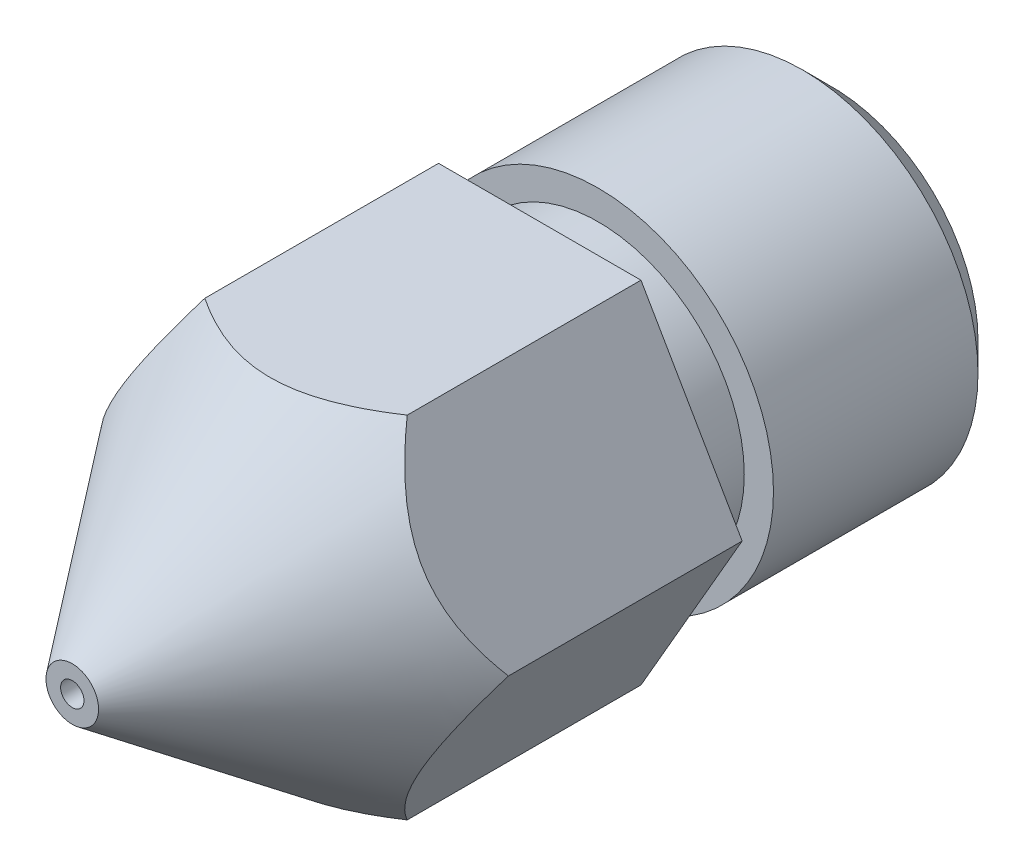
ISO-10303-21;
HEADER;
FILE_DESCRIPTION(('STEP AP214'),'2;1');
FILE_NAME('part.step','',(''),(''),'','','');
FILE_SCHEMA(('AUTOMOTIVE_DESIGN { 1 0 10303 214 1 1 1 1 }'));
ENDSEC;
DATA;
#1=APPLICATION_CONTEXT('core data for automotive mechanical design processes');
#2=APPLICATION_PROTOCOL_DEFINITION('international standard','automotive_design',2000,#1);
#3=PRODUCT_CONTEXT('',#1,'mechanical');
#4=PRODUCT('Part','Part','',(#3));
#5=PRODUCT_RELATED_PRODUCT_CATEGORY('part','',(#4));
#6=PRODUCT_DEFINITION_FORMATION('','',#4);
#7=PRODUCT_DEFINITION_CONTEXT('part definition',#1,'design');
#8=PRODUCT_DEFINITION('design','',#6,#7);
#9=PRODUCT_DEFINITION_SHAPE('','',#8);
#10=(LENGTH_UNIT() NAMED_UNIT(*) SI_UNIT(.MILLI.,.METRE.));
#11=(NAMED_UNIT(*) PLANE_ANGLE_UNIT() SI_UNIT($,.RADIAN.));
#12=(NAMED_UNIT(*) SI_UNIT($,.STERADIAN.) SOLID_ANGLE_UNIT());
#13=UNCERTAINTY_MEASURE_WITH_UNIT(LENGTH_MEASURE(1.E-05),#10,'distance_accuracy_value','');
#14=(GEOMETRIC_REPRESENTATION_CONTEXT(3) GLOBAL_UNCERTAINTY_ASSIGNED_CONTEXT((#13)) GLOBAL_UNIT_ASSIGNED_CONTEXT((#10,
#11,#12)) REPRESENTATION_CONTEXT('',''));
#15=CARTESIAN_POINT('',(0.,0.,0.));
#16=DIRECTION('',(0.,0.,1.));
#17=DIRECTION('',(1.,0.,0.));
#18=AXIS2_PLACEMENT_3D('',#15,#16,#17);
#19=CARTESIAN_POINT('',(0.,0.,0.));
#20=DIRECTION('',(0.,0.,1.));
#21=DIRECTION('',(1.,0.,0.));
#22=AXIS2_PLACEMENT_3D('',#19,#20,#21);
#23=CYLINDRICAL_SURFACE('',#22,2.5);
#24=CARTESIAN_POINT('',(0.,0.,0.));
#25=DIRECTION('',(0.,0.,1.));
#26=DIRECTION('',(1.,0.,0.));
#27=AXIS2_PLACEMENT_3D('',#24,#25,#26);
#28=CIRCLE('',#27,2.5);
#29=CARTESIAN_POINT('',(2.49999999999999,0.,0.));
#30=VERTEX_POINT('',#29);
#31=EDGE_CURVE('E20',#30,#30,#28,.F.);
#32=ORIENTED_EDGE('',*,*,#31,.T.);
#33=EDGE_LOOP('',(#32));
#34=FACE_BOUND('',#33,.T.);
#35=CARTESIAN_POINT('',(0.,0.,-1.));
#36=DIRECTION('',(0.,0.,1.));
#37=DIRECTION('',(1.,0.,0.));
#38=AXIS2_PLACEMENT_3D('',#35,#36,#37);
#39=CIRCLE('',#38,2.5);
#40=CARTESIAN_POINT('',(2.49999999999999,0.,-1.));
#41=VERTEX_POINT('',#40);
#42=EDGE_CURVE('E105',#41,#41,#39,.T.);
#43=ORIENTED_EDGE('',*,*,#42,.T.);
#44=EDGE_LOOP('',(#43));
#45=FACE_BOUND('',#44,.T.);
#46=ADVANCED_FACE('F17',(#34,#45),#23,.T.);
#47=CARTESIAN_POINT('',(0.,0.,0.));
#48=DIRECTION('',(0.,0.,1.));
#49=DIRECTION('',(1.,0.,0.));
#50=AXIS2_PLACEMENT_3D('',#47,#48,#49);
#51=PLANE('',#50);
#52=ORIENTED_EDGE('',*,*,#31,.F.);
#53=EDGE_LOOP('',(#52));
#54=FACE_BOUND('',#53,.T.);
#55=DIRECTION('',(-1.,0.,0.));
#56=VECTOR('',#55,1.);
#57=CARTESIAN_POINT('',(1.73205080756887,3.00000000000001,0.));
#58=LINE('',#57,#56);
#59=CARTESIAN_POINT('',(1.73205080756887,3.00000000000001,0.));
#60=VERTEX_POINT('',#59);
#61=CARTESIAN_POINT('',(-1.73205080756889,2.99999999999999,0.));
#62=VERTEX_POINT('',#61);
#63=EDGE_CURVE('E68',#60,#62,#58,.T.);
#64=ORIENTED_EDGE('',*,*,#63,.F.);
#65=DIRECTION('',(-0.500000000000001,0.866025403784438,0.));
#66=VECTOR('',#65,1.);
#67=CARTESIAN_POINT('',(3.46410161513776,0.,0.));
#68=LINE('',#67,#66);
#69=CARTESIAN_POINT('',(3.46410161513776,0.,0.));
#70=VERTEX_POINT('',#69);
#71=EDGE_CURVE('E98',#70,#60,#68,.T.);
#72=ORIENTED_EDGE('',*,*,#71,.F.);
#73=DIRECTION('',(0.499999999999995,0.866025403784442,0.));
#74=VECTOR('',#73,1.);
#75=CARTESIAN_POINT('',(1.73205080756891,-2.99999999999998,0.));
#76=LINE('',#75,#74);
#77=CARTESIAN_POINT('',(1.73205080756891,-2.99999999999998,0.));
#78=VERTEX_POINT('',#77);
#79=EDGE_CURVE('E103',#78,#70,#76,.T.);
#80=ORIENTED_EDGE('',*,*,#79,.F.);
#81=DIRECTION('',(1.,0.,0.));
#82=VECTOR('',#81,1.);
#83=CARTESIAN_POINT('',(-1.73205080756885,-3.00000000000002,0.));
#84=LINE('',#83,#82);
#85=CARTESIAN_POINT('',(-1.73205080756885,-3.00000000000002,0.));
#86=VERTEX_POINT('',#85);
#87=EDGE_CURVE('E109',#86,#78,#84,.T.);
#88=ORIENTED_EDGE('',*,*,#87,.F.);
#89=DIRECTION('',(0.500000000000007,-0.866025403784435,0.));
#90=VECTOR('',#89,1.);
#91=CARTESIAN_POINT('',(-3.46410161513776,0.,0.));
#92=LINE('',#91,#90);
#93=CARTESIAN_POINT('',(-3.46410161513776,0.,0.));
#94=VERTEX_POINT('',#93);
#95=EDGE_CURVE('E86',#94,#86,#92,.T.);
#96=ORIENTED_EDGE('',*,*,#95,.F.);
#97=DIRECTION('',(-0.499999999999995,-0.866025403784442,0.));
#98=VECTOR('',#97,1.);
#99=CARTESIAN_POINT('',(-1.73205080756889,2.99999999999999,0.));
#100=LINE('',#99,#98);
#101=EDGE_CURVE('E80',#62,#94,#100,.T.);
#102=ORIENTED_EDGE('',*,*,#101,.F.);
#103=EDGE_LOOP('',(#64,#72,#80,#88,#96,#102));
#104=FACE_BOUND('',#103,.T.);
#105=ADVANCED_FACE('F84',(#54,#104),#51,.F.);
#106=CARTESIAN_POINT('',(-3.46410161513776,0.,8.));
#107=DIRECTION('',(-0.866025403784435,-0.500000000000007,0.));
#108=DIRECTION('',(0.500000000000007,-0.866025403784435,0.));
#109=AXIS2_PLACEMENT_3D('',#106,#107,#108);
#110=PLANE('',#109);
#111=ORIENTED_EDGE('',*,*,#95,.T.);
#112=DIRECTION('',(0.,0.,1.));
#113=VECTOR('',#112,1.);
#114=CARTESIAN_POINT('',(-1.73205080756885,-3.00000000000002,8.));
#115=LINE('',#114,#113);
#116=CARTESIAN_POINT('',(-1.73205082261457,-2.99999997394007,4.00000001990856));
#117=VERTEX_POINT('',#116);
#118=EDGE_CURVE('E111',#117,#86,#115,.F.);
#119=ORIENTED_EDGE('',*,*,#118,.F.);
#120=CARTESIAN_POINT('',(-3.46410161512749,-1.78090844095584E-11,3.99999999995585));
#121=CARTESIAN_POINT('',(-3.44069021728598,-0.0405497305555014,4.0310628053538));
#122=CARTESIAN_POINT('',(-3.41706085238584,-0.0814769911131405,4.06148013029268));
#123=CARTESIAN_POINT('',(-3.36934820183696,-0.16411772602758,4.12079172064874));
#124=CARTESIAN_POINT('',(-3.34526518086492,-0.205830741950901,4.14968683895466));
#125=CARTESIAN_POINT('',(-3.29644056578324,-0.290397455932351,4.20594219265243));
#126=CARTESIAN_POINT('',(-3.27169567941122,-0.333256856356211,4.23329106871594));
#127=CARTESIAN_POINT('',(-3.22165527143299,-0.419929385405982,4.28600265818764));
#128=CARTESIAN_POINT('',(-3.19635926529786,-0.463743353260596,4.31136352565853));
#129=CARTESIAN_POINT('',(-3.11910484462331,-0.597551934978225,4.3845024985927));
#130=CARTESIAN_POINT('',(-3.06628459171059,-0.689039296691687,4.42874210619825));
#131=CARTESIAN_POINT('',(-2.95848675569459,-0.875750625617379,4.50488649686758));
#132=CARTESIAN_POINT('',(-2.9035124162864,-0.970968974584896,4.53680909624767));
#133=CARTESIAN_POINT('',(-2.81448457704596,-1.1251697154374,4.57560860596397));
#134=CARTESIAN_POINT('',(-2.78095977027534,-1.18323638407805,4.58739343695509));
#135=CARTESIAN_POINT('',(-2.71351247814955,-1.30005852087285,4.60510403197278));
#136=CARTESIAN_POINT('',(-2.67958993696148,-1.35881408573244,4.61102896319209));
#137=CARTESIAN_POINT('',(-2.61188290906255,-1.47608609808287,4.61672020179017));
#138=CARTESIAN_POINT('',(-2.57809943786469,-1.5346007866536,4.61653462503732));
#139=CARTESIAN_POINT('',(-2.51067843635983,-1.6513773867572,4.61013433411967));
#140=CARTESIAN_POINT('',(-2.47704090125166,-1.70963930660593,4.6039198198358));
#141=CARTESIAN_POINT('',(-2.41030893019044,-1.82522247097317,4.58577671747795));
#142=CARTESIAN_POINT('',(-2.37721275011841,-1.88254673639436,4.57387352526923));
#143=CARTESIAN_POINT('',(-2.31159334327444,-1.99620288301066,4.54483585433414));
#144=CARTESIAN_POINT('',(-2.27907037936965,-2.05253430890648,4.52769903835235));
#145=CARTESIAN_POINT('',(-2.18215411721515,-2.22039819903774,4.46905909519213));
#146=CARTESIAN_POINT('',(-2.11882576441585,-2.33008612364577,4.42045072352064));
#147=CARTESIAN_POINT('',(-1.99999917816462,-2.53589980832286,4.313482497851));
#148=CARTESIAN_POINT('',(-1.94426869692903,-2.63242783335316,4.25611473073038));
#149=CARTESIAN_POINT('',(-1.86291673372508,-2.77333356691788,4.16391653954198));
#150=CARTESIAN_POINT('',(-1.83634125898785,-2.81936363939803,4.13238684651579));
#151=CARTESIAN_POINT('',(-1.78377384701409,-2.91041306775898,4.06749851398277));
#152=CARTESIAN_POINT('',(-1.75778159469871,-2.95543296937237,4.03414089723963));
#153=CARTESIAN_POINT('',(-1.73205083766029,-2.99999994788013,4.0000000398749));
#154=B_SPLINE_CURVE_WITH_KNOTS('',3,(#120,#121,#122,#123,#124,#125,#126,#127,#128,#129,#130,
#131,#132,#133,#134,#135,#136,#137,#138,#139,#140,#141,#142,#143,#144,#145,#146,#147,#148,#149,
#150,#151,#152,#153),.UNSPECIFIED.,.F.,.F.,(4,2,2,2,2,2,2,2,2,2,2,2,2,2,2,2,4),(0.,
0.168572565033998,0.337049652156391,0.506636087692028,0.676378169632626,1.01936499807178,
1.36185382588792,1.56586036237278,1.7698958880427,1.9723251673403,2.17474773560912,
2.37627495577819,2.57789230681761,2.98360296012187,3.3591882030421,3.54455388709552,
3.72981689344194),.UNSPECIFIED.);
#155=CARTESIAN_POINT('',(-3.46410161513399,0.,3.99999999996893));
#156=VERTEX_POINT('',#155);
#157=EDGE_CURVE('E88',#156,#117,#154,.T.);
#158=ORIENTED_EDGE('',*,*,#157,.F.);
#159=DIRECTION('',(0.,0.,1.));
#160=VECTOR('',#159,1.);
#161=CARTESIAN_POINT('',(-3.46410161513776,0.,8.));
#162=LINE('',#161,#160);
#163=EDGE_CURVE('E34',#94,#156,#162,.T.);
#164=ORIENTED_EDGE('',*,*,#163,.F.);
#165=EDGE_LOOP('',(#111,#119,#158,#164));
#166=FACE_BOUND('',#165,.T.);
#167=ADVANCED_FACE('F184',(#166),#110,.T.);
#168=CARTESIAN_POINT('',(-1.73205080756885,-3.00000000000002,8.));
#169=DIRECTION('',(0.,-1.,0.));
#170=DIRECTION('',(1.,0.,0.));
#171=AXIS2_PLACEMENT_3D('',#168,#169,#170);
#172=PLANE('',#171);
#173=ORIENTED_EDGE('',*,*,#87,.T.);
#174=DIRECTION('',(0.,0.,1.));
#175=VECTOR('',#174,1.);
#176=CARTESIAN_POINT('',(1.73205080756891,-2.99999999999998,8.));
#177=LINE('',#176,#175);
#178=CARTESIAN_POINT('',(1.73205077747104,-2.99999999999998,4.00000001991283));
#179=VERTEX_POINT('',#178);
#180=EDGE_CURVE('E106',#179,#78,#177,.F.);
#181=ORIENTED_EDGE('',*,*,#180,.F.);
#182=CARTESIAN_POINT('',(-1.73205080390475,-2.99999997395749,3.99999998902961));
#183=CARTESIAN_POINT('',(-1.68522801225279,-2.9999999906465,4.03106280033602));
#184=CARTESIAN_POINT('',(-1.63796928421497,-2.99999999749357,4.06148012765403));
#185=CARTESIAN_POINT('',(-1.54254398469325,-3.00000000250505,4.12079171963457));
#186=CARTESIAN_POINT('',(-1.4943779425648,-3.00000000067438,4.1496868371891));
#187=CARTESIAN_POINT('',(-1.39672871265291,-2.99999999932121,4.2059421901906));
#188=CARTESIAN_POINT('',(-1.34723894034983,-2.99999999981398,4.23329106631756));
#189=CARTESIAN_POINT('',(-1.24715812512532,-3.00000000018622,4.28600265574057));
#190=CARTESIAN_POINT('',(-1.19656611314546,-3.00000000006513,4.31136352309826));
#191=CARTESIAN_POINT('',(-1.04205727283146,-2.99999999986843,4.38450249576049));
#192=CARTESIAN_POINT('',(-0.936416767816112,-2.99999999996537,4.42874210333507));
#193=CARTESIAN_POINT('',(-0.720821097463859,-3.00000000003459,4.50488649411916));
#194=CARTESIAN_POINT('',(-0.610872419518798,-3.00000000000705,4.53680909364931));
#195=CARTESIAN_POINT('',(-0.432816742046975,-2.99999999999581,4.57560860393632));
#196=CARTESIAN_POINT('',(-0.365767128635706,-2.99999999999888,4.58739343521679));
#197=CARTESIAN_POINT('',(-0.230872544635614,-3.00000000000113,4.60510403084387));
#198=CARTESIAN_POINT('',(-0.16302746238116,-3.0000000000003,4.61102896238462));
#199=CARTESIAN_POINT('',(-0.0276134067728522,-2.9999999999997,4.61672020164859));
#200=CARTESIAN_POINT('',(0.0399535355548584,-2.99999999999992,4.61653462523792));
#201=CARTESIAN_POINT('',(0.174795538465503,-3.00000000000008,4.61013433500813));
#202=CARTESIAN_POINT('',(0.242070608650749,-3.00000000000002,4.60391982106944));
#203=CARTESIAN_POINT('',(0.375534550747317,-2.99999999999998,4.58577671938737));
#204=CARTESIAN_POINT('',(0.441726910896373,-2.99999999999999,4.57387352750857));
#205=CARTESIAN_POINT('',(0.572965724614914,-3.,4.54483585721002));
#206=CARTESIAN_POINT('',(0.638011652450085,-3.,4.52769904153483));
#207=CARTESIAN_POINT('',(0.831844176842158,-2.99999999999999,4.4690590992579));
#208=CARTESIAN_POINT('',(0.958500882518724,-2.99999999999999,4.42045072812008));
#209=CARTESIAN_POINT('',(1.19615405717397,-2.99999999999999,4.31348250246958));
#210=CARTESIAN_POINT('',(1.30761502162218,-2.99999999999999,4.25611473463496));
#211=CARTESIAN_POINT('',(1.47031895084624,-2.99999999999998,4.16391654213468));
#212=CARTESIAN_POINT('',(1.52346990122852,-2.99999999999998,4.13238684863528));
#213=CARTESIAN_POINT('',(1.62860472694999,-2.99999999999998,4.06749851509162));
#214=CARTESIAN_POINT('',(1.68058923244697,-2.99999999999998,4.03414089781116));
#215=CARTESIAN_POINT('',(1.73205074737316,-2.99999999999998,4.00000003988345));
#216=B_SPLINE_CURVE_WITH_KNOTS('',3,(#182,#183,#184,#185,#186,#187,#188,#189,#190,#191,#192,
#193,#194,#195,#196,#197,#198,#199,#200,#201,#202,#203,#204,#205,#206,#207,#208,#209,#210,#211,
#212,#213,#214,#215),.UNSPECIFIED.,.F.,.F.,(4,2,2,2,2,2,2,2,2,2,2,2,2,2,2,2,4),(0.,
0.168572564445729,0.337049650810836,0.50663608532369,0.676378166317596,1.01936499251818,
1.36185381797032,1.56586035422516,1.76989587961715,1.97232515870881,2.17474772678902,
2.37627494679629,2.57789229767387,2.98360295060958,3.35918819974785,3.54455388686658,
3.72981689626899),.UNSPECIFIED.);
#217=EDGE_CURVE('E170',#117,#179,#216,.T.);
#218=ORIENTED_EDGE('',*,*,#217,.F.);
#219=ORIENTED_EDGE('',*,*,#118,.T.);
#220=EDGE_LOOP('',(#173,#181,#218,#219));
#221=FACE_BOUND('',#220,.T.);
#222=ADVANCED_FACE('F179',(#221),#172,.T.);
#223=CARTESIAN_POINT('',(1.73205080756891,-2.99999999999998,8.));
#224=DIRECTION('',(0.866025403784442,-0.499999999999995,0.));
#225=DIRECTION('',(0.499999999999995,0.866025403784442,0.));
#226=AXIS2_PLACEMENT_3D('',#223,#224,#225);
#227=PLANE('',#226);
#228=ORIENTED_EDGE('',*,*,#79,.T.);
#229=DIRECTION('',(0.,0.,1.));
#230=VECTOR('',#229,1.);
#231=CARTESIAN_POINT('',(3.46410161513776,0.,8.));
#232=LINE('',#231,#230);
#233=CARTESIAN_POINT('',(3.46410161513021,0.,3.99999999995224));
#234=VERTEX_POINT('',#233);
#235=EDGE_CURVE('E100',#234,#70,#232,.F.);
#236=ORIENTED_EDGE('',*,*,#235,.F.);
#237=CARTESIAN_POINT('',(1.73205078683702,-2.9999999838129,3.99999998901916));
#238=CARTESIAN_POINT('',(1.75546219711762,-2.95945026511495,4.03106280032556));
#239=CARTESIAN_POINT('',(1.77909156706624,-2.91852300951005,4.0614801276429));
#240=CARTESIAN_POINT('',(1.82680422116572,-2.83588227847082,4.12079171962161));
#241=CARTESIAN_POINT('',(1.85088724064311,-2.79416926147422,4.14968683717497));
#242=CARTESIAN_POINT('',(1.89971185442462,-2.70960254703781,4.2059421901745));
#243=CARTESIAN_POINT('',(1.92445674100179,-2.66674314724437,4.23329106630065));
#244=CARTESIAN_POINT('',(1.97449714893402,-2.58007061901892,4.28600265572225));
#245=CARTESIAN_POINT('',(1.99979315481781,-2.5362566513574,4.31136352307933));
#246=CARTESIAN_POINT('',(2.07704757480595,-2.40244807043521,4.38450249574526));
#247=CARTESIAN_POINT('',(2.12986782740052,-2.31096070946671,4.42874210332363));
#248=CARTESIAN_POINT('',(2.23766566264272,-2.12424938201975,4.50488649411404));
#249=CARTESIAN_POINT('',(2.2926400015946,-2.0290310337875,4.53680909364672));
#250=CARTESIAN_POINT('',(2.38166784032611,-1.87483029379397,4.57560860393638));
#251=CARTESIAN_POINT('',(2.41519264703649,-1.81676362526382,4.58739343521754));
#252=CARTESIAN_POINT('',(2.48263993904267,-1.69994148868068,4.60510403084524));
#253=CARTESIAN_POINT('',(2.51656248017129,-1.64118592392241,4.61102896238593));
#254=CARTESIAN_POINT('',(2.58426950797496,-1.52391391173578,4.61672020164866));
#255=CARTESIAN_POINT('',(2.61805297913691,-1.46539922322767,4.61653462523756));
#256=CARTESIAN_POINT('',(2.68547398058824,-1.34862262321711,4.61013433500767));
#257=CARTESIAN_POINT('',(2.71911151567878,-1.2903607033988,4.60391982106929));
#258=CARTESIAN_POINT('',(2.78584348671839,-1.17477753906889,4.58577671938979));
#259=CARTESIAN_POINT('',(2.81893966678639,-1.11745327365469,4.57387352751402));
#260=CARTESIAN_POINT('',(2.88455907363292,-1.00379712703399,4.54483585722354));
#261=CARTESIAN_POINT('',(2.9170820375443,-0.947465701126749,4.52769904155341));
#262=CARTESIAN_POINT('',(3.01399829974689,-0.779601810912185,4.46905909927857));
#263=CARTESIAN_POINT('',(3.07732665259602,-0.669913886217841,4.42045072813286));
#264=CARTESIAN_POINT('',(3.19615324550639,-0.464100190006776,4.31348249746097));
#265=CARTESIAN_POINT('',(3.25188373303114,-0.367572154083333,4.25611472345713));
#266=CARTESIAN_POINT('',(3.33323570517356,-0.226666405036735,4.16391652072528));
#267=CARTESIAN_POINT('',(3.35981118277317,-0.180636327598797,4.13238682370177));
#268=CARTESIAN_POINT('',(3.41237860034698,-0.0895868895382563,4.06749848284485));
#269=CARTESIAN_POINT('',(3.43837085540024,-0.0445669831827226,4.03414086177575));
#270=CARTESIAN_POINT('',(3.46410161512749,-1.77906543640029E-11,3.99999999995585));
#271=B_SPLINE_CURVE_WITH_KNOTS('',3,(#237,#238,#239,#240,#241,#242,#243,#244,#245,#246,#247,
#248,#249,#250,#251,#252,#253,#254,#255,#256,#257,#258,#259,#260,#261,#262,#263,#264,#265,#266,
#267,#268,#269,#270),.UNSPECIFIED.,.F.,.F.,(4,2,2,2,2,2,2,2,2,2,2,2,2,2,2,2,4),(0.,
0.168572564438344,0.337049650796003,0.50663608530132,0.676378166287717,1.01936499250879,
1.36185381798131,1.56586035424876,1.76989587965327,1.97232515873247,2.17474772680038,
2.37627494676785,2.57789229760461,2.98360295062125,3.35918823635118,3.54455394128791,
3.72981696846106),.UNSPECIFIED.);
#272=EDGE_CURVE('E165',#179,#234,#271,.T.);
#273=ORIENTED_EDGE('',*,*,#272,.F.);
#274=ORIENTED_EDGE('',*,*,#180,.T.);
#275=EDGE_LOOP('',(#228,#236,#273,#274));
#276=FACE_BOUND('',#275,.T.);
#277=ADVANCED_FACE('F176',(#276),#227,.T.);
#278=CARTESIAN_POINT('',(2.99999999999999,0.,-1.));
#279=DIRECTION('',(0.,0.,-1.));
#280=DIRECTION('',(-1.,0.,0.));
#281=AXIS2_PLACEMENT_3D('',#278,#279,#280);
#282=PLANE('',#281);
#283=CARTESIAN_POINT('',(0.,0.,-1.));
#284=DIRECTION('',(0.,0.,1.));
#285=DIRECTION('',(1.,0.,0.));
#286=AXIS2_PLACEMENT_3D('',#283,#284,#285);
#287=CIRCLE('',#286,2.99999999999999);
#288=CARTESIAN_POINT('',(2.99999999999999,0.,-1.));
#289=VERTEX_POINT('',#288);
#290=EDGE_CURVE('E162',#289,#289,#287,.F.);
#291=ORIENTED_EDGE('',*,*,#290,.F.);
#292=EDGE_LOOP('',(#291));
#293=FACE_BOUND('',#292,.T.);
#294=ORIENTED_EDGE('',*,*,#42,.F.);
#295=EDGE_LOOP('',(#294));
#296=FACE_BOUND('',#295,.T.);
#297=ADVANCED_FACE('F154',(#293,#296),#282,.F.);
#298=CARTESIAN_POINT('',(3.46410161513776,0.,8.));
#299=DIRECTION('',(0.866025403784438,0.500000000000001,0.));
#300=DIRECTION('',(-0.500000000000001,0.866025403784438,0.));
#301=AXIS2_PLACEMENT_3D('',#298,#299,#300);
#302=PLANE('',#301);
#303=ORIENTED_EDGE('',*,*,#71,.T.);
#304=DIRECTION('',(0.,0.,1.));
#305=VECTOR('',#304,1.);
#306=CARTESIAN_POINT('',(1.73205080756887,3.00000000000001,8.));
#307=LINE('',#306,#305);
#308=CARTESIAN_POINT('',(1.73205082261745,2.9999999739351,4.00000001991236));
#309=VERTEX_POINT('',#308);
#310=EDGE_CURVE('E74',#309,#60,#307,.F.);
#311=ORIENTED_EDGE('',*,*,#310,.F.);
#312=CARTESIAN_POINT('',(3.46410161512749,1.77913089255884E-11,3.99999999995585));
#313=CARTESIAN_POINT('',(3.44069021728598,0.040549730555484,4.03106280535381));
#314=CARTESIAN_POINT('',(3.41706085238583,0.0814769911131235,4.06148013029268));
#315=CARTESIAN_POINT('',(3.36934820183695,0.164117726027563,4.12079172064874));
#316=CARTESIAN_POINT('',(3.34526518086491,0.205830741950885,4.14968683895466));
#317=CARTESIAN_POINT('',(3.29644056578324,0.290397455932336,4.20594219265243));
#318=CARTESIAN_POINT('',(3.27169567941122,0.333256856356197,4.23329106871595));
#319=CARTESIAN_POINT('',(3.22165527143299,0.419929385405969,4.28600265818764));
#320=CARTESIAN_POINT('',(3.19635926529786,0.463743353260583,4.31136352565853));
#321=CARTESIAN_POINT('',(3.1191048446233,0.597551934978212,4.3845024985927));
#322=CARTESIAN_POINT('',(3.06628459171059,0.689039296691673,4.42874210619826));
#323=CARTESIAN_POINT('',(2.95848675569459,0.875750625617363,4.50488649686758));
#324=CARTESIAN_POINT('',(2.9035124162864,0.970968974584879,4.53680909624767));
#325=CARTESIAN_POINT('',(2.81448457704597,1.12516971543738,4.57560860596397));
#326=CARTESIAN_POINT('',(2.78095977027535,1.18323638407803,4.58739343695509));
#327=CARTESIAN_POINT('',(2.71351247814956,1.30005852087283,4.60510403197278));
#328=CARTESIAN_POINT('',(2.67958993696149,1.35881408573242,4.61102896319209));
#329=CARTESIAN_POINT('',(2.61188290906256,1.47608609808285,4.61672020179017));
#330=CARTESIAN_POINT('',(2.5780994378647,1.53460078665358,4.61653462503732));
#331=CARTESIAN_POINT('',(2.51067843635984,1.65137738675718,4.61013433411967));
#332=CARTESIAN_POINT('',(2.47704090125167,1.70963930660591,4.6039198198358));
#333=CARTESIAN_POINT('',(2.41030893019045,1.82522247097316,4.58577671747795));
#334=CARTESIAN_POINT('',(2.37721275011842,1.88254673639435,4.57387352526923));
#335=CARTESIAN_POINT('',(2.31159334327445,1.99620288301065,4.54483585433414));
#336=CARTESIAN_POINT('',(2.27907037936966,2.05253430890647,4.52769903835235));
#337=CARTESIAN_POINT('',(2.18215411721516,2.22039819903773,4.46905909519213));
#338=CARTESIAN_POINT('',(2.11882576441586,2.33008612364576,4.42045072352064));
#339=CARTESIAN_POINT('',(1.9999991781657,2.53589980832101,4.31348249785196));
#340=CARTESIAN_POINT('',(1.94426869693112,2.63242783334956,4.25611473073251));
#341=CARTESIAN_POINT('',(1.8629167337286,2.7733335669118,4.16391653954606));
#342=CARTESIAN_POINT('',(1.83634125899183,2.81936363939115,4.13238684652054));
#343=CARTESIAN_POINT('',(1.78377384701897,2.91041306775054,4.06749851398892));
#344=CARTESIAN_POINT('',(1.75778159470403,2.95543296936317,4.03414089724649));
#345=CARTESIAN_POINT('',(1.73205083766604,2.99999994787019,4.00000003988251));
#346=B_SPLINE_CURVE_WITH_KNOTS('',3,(#312,#313,#314,#315,#316,#317,#318,#319,#320,#321,#322,
#323,#324,#325,#326,#327,#328,#329,#330,#331,#332,#333,#334,#335,#336,#337,#338,#339,#340,#341,
#342,#343,#344,#345),.UNSPECIFIED.,.F.,.F.,(4,2,2,2,2,2,2,2,2,2,2,2,2,2,2,2,4),(0.,
0.168572565033999,0.337049652156393,0.506636087692031,0.67637816963263,1.01936499807178,
1.36185382588791,1.56586036237277,1.76989588804269,1.97232516734029,2.17474773560911,
2.37627495577819,2.57789230681762,2.98360296012186,3.35918820303512,3.54455388708515,
3.72981689342818),.UNSPECIFIED.);
#347=EDGE_CURVE('E157',#234,#309,#346,.T.);
#348=ORIENTED_EDGE('',*,*,#347,.F.);
#349=ORIENTED_EDGE('',*,*,#235,.T.);
#350=EDGE_LOOP('',(#303,#311,#348,#349));
#351=FACE_BOUND('',#350,.T.);
#352=ADVANCED_FACE('F150',(#351),#302,.T.);
#353=CARTESIAN_POINT('',(1.73205080756887,3.00000000000001,8.));
#354=DIRECTION('',(0.,1.,0.));
#355=DIRECTION('',(-1.,0.,0.));
#356=AXIS2_PLACEMENT_3D('',#353,#354,#355);
#357=PLANE('',#356);
#358=ORIENTED_EDGE('',*,*,#63,.T.);
#359=DIRECTION('',(0.,0.,1.));
#360=VECTOR('',#359,1.);
#361=CARTESIAN_POINT('',(-1.73205080756889,2.99999999999999,8.));
#362=LINE('',#361,#360);
#363=CARTESIAN_POINT('',(-1.73205077747843,2.99999999999999,4.00000001990792));
#364=VERTEX_POINT('',#363);
#365=EDGE_CURVE('E72',#364,#62,#362,.F.);
#366=ORIENTED_EDGE('',*,*,#365,.F.);
#367=CARTESIAN_POINT('',(1.73205080391511,2.99999997395271,3.99999998902031));
#368=CARTESIAN_POINT('',(1.68522801226358,2.99999999064478,4.03106280032815));
#369=CARTESIAN_POINT('',(1.63796928422576,2.9999999974931,4.06148012764695));
#370=CARTESIAN_POINT('',(1.54254398470369,3.0000000025055,4.12079171962848));
#371=CARTESIAN_POINT('',(1.49437794257489,3.0000000006745,4.14968683718321));
#372=CARTESIAN_POINT('',(1.39672871266237,2.99999999932107,4.20594219018526));
#373=CARTESIAN_POINT('',(1.34723894035902,2.99999999981393,4.23329106631256));
#374=CARTESIAN_POINT('',(1.24715812513394,3.00000000018625,4.28600265573621));
#375=CARTESIAN_POINT('',(1.19656611315377,3.00000000006514,4.31136352309419));
#376=CARTESIAN_POINT('',(1.04205727283882,2.9999999998684,4.38450249575731));
#377=CARTESIAN_POINT('',(0.936416767822808,2.99999999996536,4.42874210333246));
#378=CARTESIAN_POINT('',(0.720821097469165,3.0000000000346,4.50488649411755));
#379=CARTESIAN_POINT('',(0.610872419523375,3.00000000000705,4.53680909364814));
#380=CARTESIAN_POINT('',(0.432816742050784,2.9999999999958,4.5756086039356));
#381=CARTESIAN_POINT('',(0.365767128639503,2.99999999999888,4.58739343521618));
#382=CARTESIAN_POINT('',(0.230872544639381,3.00000000000113,4.60510403084349));
#383=CARTESIAN_POINT('',(0.163027462384909,3.0000000000003,4.61102896238436));
#384=CARTESIAN_POINT('',(0.0276134067765566,2.9999999999997,4.61672020164855));
#385=CARTESIAN_POINT('',(-0.0399535355511795,2.99999999999992,4.61653462523799));
#386=CARTESIAN_POINT('',(-0.174795538461885,3.00000000000008,4.61013433500841));
#387=CARTESIAN_POINT('',(-0.242070608647167,3.00000000000002,4.60391982106982));
#388=CARTESIAN_POINT('',(-0.375534550743816,2.99999999999998,4.58577671938794));
#389=CARTESIAN_POINT('',(-0.441726910892917,2.99999999999999,4.57387352750923));
#390=CARTESIAN_POINT('',(-0.572965724611553,3.,4.54483585721085));
#391=CARTESIAN_POINT('',(-0.638011652446773,3.,4.52769904153574));
#392=CARTESIAN_POINT('',(-0.831844176839013,2.99999999999999,4.46905909925901));
#393=CARTESIAN_POINT('',(-0.958500882515699,3.,4.4204507281213));
#394=CARTESIAN_POINT('',(-1.19615405717434,3.,4.31348250246953));
#395=CARTESIAN_POINT('',(-1.30761502162567,3.,4.2561147346332));
#396=CARTESIAN_POINT('',(-1.47031895085417,3.,4.16391654213006));
#397=CARTESIAN_POINT('',(-1.52346990123786,3.,4.13238684862967));
#398=CARTESIAN_POINT('',(-1.62860472696211,2.99999999999999,4.06749851508396));
#399=CARTESIAN_POINT('',(-1.68058923246044,2.99999999999999,4.03414089780242));
#400=CARTESIAN_POINT('',(-1.73205074738797,2.99999999999999,4.00000003987361));
#401=B_SPLINE_CURVE_WITH_KNOTS('',3,(#367,#368,#369,#370,#371,#372,#373,#374,#375,#376,#377,
#378,#379,#380,#381,#382,#383,#384,#385,#386,#387,#388,#389,#390,#391,#392,#393,#394,#395,#396,
#397,#398,#399,#400),.UNSPECIFIED.,.F.,.F.,(4,2,2,2,2,2,2,2,2,2,2,2,2,2,2,2,4),(0.,
0.168572564446985,0.337049650813314,0.506636085327373,0.6763781663225,1.01936499252557,
1.36185381798016,1.56586035423509,1.76989587962717,1.9723251587189,2.17474772679919,
2.37627494680655,2.5778922976842,2.98360295062013,3.35918819976902,3.54455388689293,
3.72981689630049),.UNSPECIFIED.);
#402=EDGE_CURVE('E134',#309,#364,#401,.T.);
#403=ORIENTED_EDGE('',*,*,#402,.F.);
#404=ORIENTED_EDGE('',*,*,#310,.T.);
#405=EDGE_LOOP('',(#358,#366,#403,#404));
#406=FACE_BOUND('',#405,.T.);
#407=ADVANCED_FACE('F70',(#406),#357,.T.);
#408=CARTESIAN_POINT('',(-1.73205080756889,2.99999999999999,8.));
#409=DIRECTION('',(-0.866025403784442,0.499999999999995,0.));
#410=DIRECTION('',(-0.499999999999995,-0.866025403784442,0.));
#411=AXIS2_PLACEMENT_3D('',#408,#409,#410);
#412=PLANE('',#411);
#413=ORIENTED_EDGE('',*,*,#101,.T.);
#414=ORIENTED_EDGE('',*,*,#163,.T.);
#415=CARTESIAN_POINT('',(-1.73205078684902,2.99999998380441,3.99999998903119));
#416=CARTESIAN_POINT('',(-1.75546219712648,2.95945026510401,4.03106280033573));
#417=CARTESIAN_POINT('',(-1.7790915670737,2.9185230094983,4.06148012765206));
#418=CARTESIAN_POINT('',(-1.82680422117192,2.83588227845886,4.12079171962949));
#419=CARTESIAN_POINT('',(-1.85088724064946,2.79416926146288,4.14968683718259));
#420=CARTESIAN_POINT('',(-1.89971185443085,2.70960254702733,4.20594219018142));
#421=CARTESIAN_POINT('',(-1.92445674100774,2.66674314723413,4.23329106630712));
#422=CARTESIAN_POINT('',(-1.97449714893952,2.58007061900928,4.28600265572789));
#423=CARTESIAN_POINT('',(-1.99979315482314,2.53625665134812,4.31136352308459));
#424=CARTESIAN_POINT('',(-2.0770475748107,2.40244807042701,4.38450249574939));
#425=CARTESIAN_POINT('',(-2.12986782740482,2.31096070945925,4.42874210332703));
#426=CARTESIAN_POINT('',(-2.23766566264612,2.12424938201382,4.50488649411614));
#427=CARTESIAN_POINT('',(-2.29264000159753,2.02903103378239,4.53680909364826));
#428=CARTESIAN_POINT('',(-2.38166784032855,1.87483029378972,4.57560860393733));
#429=CARTESIAN_POINT('',(-2.41519264703892,1.81676362525958,4.58739343521834));
#430=CARTESIAN_POINT('',(-2.48263993904508,1.69994148867647,4.60510403084575));
#431=CARTESIAN_POINT('',(-2.51656248017369,1.64118592391822,4.61102896238629));
#432=CARTESIAN_POINT('',(-2.58426950797733,1.52391391173164,4.61672020164873));
#433=CARTESIAN_POINT('',(-2.61805297913927,1.46539922322357,4.6165346252375));
#434=CARTESIAN_POINT('',(-2.68547398059056,1.34862262321307,4.61013433500732));
#435=CARTESIAN_POINT('',(-2.71911151568107,1.29036070339481,4.60391982106882));
#436=CARTESIAN_POINT('',(-2.78584348672063,1.17477753906499,4.58577671938907));
#437=CARTESIAN_POINT('',(-2.8189396667886,1.11745327365085,4.57387352751318));
#438=CARTESIAN_POINT('',(-2.88455907363506,1.00379712703026,4.54483585722248));
#439=CARTESIAN_POINT('',(-2.91708203754641,0.947465701123077,4.52769904155225));
#440=CARTESIAN_POINT('',(-3.01399829974889,0.779601810908697,4.46905909927715));
#441=CARTESIAN_POINT('',(-3.07732665259795,0.669913886214482,4.42045072813131));
#442=CARTESIAN_POINT('',(-3.1961532455079,0.464100190004136,4.31348249745946));
#443=CARTESIAN_POINT('',(-3.25188373303232,0.36757215408126,4.25611472345586));
#444=CARTESIAN_POINT('',(-3.33323570517427,0.226666405035468,4.16391652072444));
#445=CARTESIAN_POINT('',(-3.35981118277374,0.180636327597788,4.13238682370108));
#446=CARTESIAN_POINT('',(-3.41237860034726,0.089586889537751,4.06749848284449));
#447=CARTESIAN_POINT('',(-3.43837085540038,0.0445669831824632,4.03414086177557));
#448=CARTESIAN_POINT('',(-3.46410161512748,1.77726889726725E-11,3.99999999995585));
#449=B_SPLINE_CURVE_WITH_KNOTS('',3,(#415,#416,#417,#418,#419,#420,#421,#422,#423,#424,#425,
#426,#427,#428,#429,#430,#431,#432,#433,#434,#435,#436,#437,#438,#439,#440,#441,#442,#443,#444,
#445,#446,#447,#448),.UNSPECIFIED.,.F.,.F.,(4,2,2,2,2,2,2,2,2,2,2,2,2,2,2,2,4),(0.,
0.16857256443672,0.3370496507928,0.50663608529656,0.676378166281376,1.01936499249925,
1.36185381796861,1.56586035423594,1.76989587964034,1.97232515871945,2.17474772678725,
2.37627494675459,2.57789229759124,2.98360295060762,3.35918823633549,3.54455394127122,
3.72981696844336),.UNSPECIFIED.);
#450=EDGE_CURVE('E82',#364,#156,#449,.T.);
#451=ORIENTED_EDGE('',*,*,#450,.F.);
#452=ORIENTED_EDGE('',*,*,#365,.T.);
#453=EDGE_LOOP('',(#413,#414,#451,#452));
#454=FACE_BOUND('',#453,.T.);
#455=ADVANCED_FACE('F79',(#454),#412,.T.);
#456=CARTESIAN_POINT('',(0.,0.,-5.));
#457=DIRECTION('',(0.,0.,1.));
#458=DIRECTION('',(1.,0.,0.));
#459=AXIS2_PLACEMENT_3D('',#456,#457,#458);
#460=CYLINDRICAL_SURFACE('',#459,2.99999999999999);
#461=ORIENTED_EDGE('',*,*,#290,.T.);
#462=EDGE_LOOP('',(#461));
#463=FACE_BOUND('',#462,.T.);
#464=CARTESIAN_POINT('',(0.,0.,-4.50000000000728));
#465=DIRECTION('',(0.,0.,1.));
#466=DIRECTION('',(1.,0.,0.));
#467=AXIS2_PLACEMENT_3D('',#464,#465,#466);
#468=CIRCLE('',#467,2.9999999999859);
#469=CARTESIAN_POINT('',(2.9999999999859,0.,-4.50000000000728));
#470=VERTEX_POINT('',#469);
#471=EDGE_CURVE('E127',#470,#470,#468,.F.);
#472=ORIENTED_EDGE('',*,*,#471,.F.);
#473=EDGE_LOOP('',(#472));
#474=FACE_BOUND('',#473,.T.);
#475=ADVANCED_FACE('F146',(#463,#474),#460,.T.);
#476=CARTESIAN_POINT('',(0.,0.,3.97599999996601));
#477=DIRECTION('',(0.,0.,-1.));
#478=DIRECTION('',(-1.,0.,0.));
#479=AXIS2_PLACEMENT_3D('',#476,#477,#478);
#480=CONICAL_SURFACE('',#479,3.48218691232205,0.645771823231257);
#481=ORIENTED_EDGE('',*,*,#272,.T.);
#482=ORIENTED_EDGE('',*,*,#347,.T.);
#483=ORIENTED_EDGE('',*,*,#402,.T.);
#484=ORIENTED_EDGE('',*,*,#450,.T.);
#485=ORIENTED_EDGE('',*,*,#157,.T.);
#486=ORIENTED_EDGE('',*,*,#217,.T.);
#487=EDGE_LOOP('',(#481,#482,#483,#484,#485,#486));
#488=FACE_BOUND('',#487,.T.);
#489=CARTESIAN_POINT('',(0.,0.,8.0000000000382));
#490=DIRECTION('',(0.,0.,-1.));
#491=DIRECTION('',(-1.,0.,0.));
#492=AXIS2_PLACEMENT_3D('',#489,#490,#491);
#493=CIRCLE('',#492,0.449885414695927);
#494=CARTESIAN_POINT('',(-0.449885414695927,0.,8.0000000000382));
#495=VERTEX_POINT('',#494);
#496=EDGE_CURVE('E124',#495,#495,#493,.F.);
#497=ORIENTED_EDGE('',*,*,#496,.F.);
#498=EDGE_LOOP('',(#497));
#499=FACE_BOUND('',#498,.T.);
#500=ADVANCED_FACE('F140',(#488,#499),#480,.T.);
#501=CARTESIAN_POINT('',(0.,0.,-4.50000000006412));
#502=DIRECTION('',(0.,0.,1.));
#503=DIRECTION('',(1.,0.,0.));
#504=AXIS2_PLACEMENT_3D('',#501,#502,#503);
#505=CONICAL_SURFACE('',#504,2.99999999987222,0.785398163340605);
#506=ORIENTED_EDGE('',*,*,#471,.T.);
#507=EDGE_LOOP('',(#506));
#508=FACE_BOUND('',#507,.T.);
#509=CARTESIAN_POINT('',(0.,0.,-4.99999999999545));
#510=DIRECTION('',(0.,0.,1.));
#511=DIRECTION('',(1.,0.,0.));
#512=AXIS2_PLACEMENT_3D('',#509,#510,#511);
#513=CIRCLE('',#512,2.49999999999773);
#514=CARTESIAN_POINT('',(2.49999999999773,0.,-4.99999999999545));
#515=VERTEX_POINT('',#514);
#516=EDGE_CURVE('E121',#515,#515,#513,.F.);
#517=ORIENTED_EDGE('',*,*,#516,.F.);
#518=EDGE_LOOP('',(#517));
#519=FACE_BOUND('',#518,.T.);
#520=ADVANCED_FACE('F250',(#508,#519),#505,.T.);
#521=CARTESIAN_POINT('',(0.,0.,8.));
#522=DIRECTION('',(0.,0.,1.));
#523=DIRECTION('',(1.,0.,0.));
#524=AXIS2_PLACEMENT_3D('',#521,#522,#523);
#525=PLANE('',#524);
#526=ORIENTED_EDGE('',*,*,#496,.T.);
#527=EDGE_LOOP('',(#526));
#528=FACE_BOUND('',#527,.T.);
#529=CARTESIAN_POINT('',(0.,0.,8.));
#530=DIRECTION('',(0.,0.,1.));
#531=DIRECTION('',(1.,0.,0.));
#532=AXIS2_PLACEMENT_3D('',#529,#530,#531);
#533=CIRCLE('',#532,0.2);
#534=CARTESIAN_POINT('',(0.2,0.,8.));
#535=VERTEX_POINT('',#534);
#536=EDGE_CURVE('E118',#535,#535,#533,.F.);
#537=ORIENTED_EDGE('',*,*,#536,.T.);
#538=EDGE_LOOP('',(#537));
#539=FACE_BOUND('',#538,.T.);
#540=ADVANCED_FACE('F247',(#528,#539),#525,.T.);
#541=CARTESIAN_POINT('',(0.,0.,-5.));
#542=DIRECTION('',(0.,0.,-1.));
#543=DIRECTION('',(-1.,0.,0.));
#544=AXIS2_PLACEMENT_3D('',#541,#542,#543);
#545=PLANE('',#544);
#546=ORIENTED_EDGE('',*,*,#516,.T.);
#547=EDGE_LOOP('',(#546));
#548=FACE_BOUND('',#547,.T.);
#549=CARTESIAN_POINT('',(0.,0.,-4.99999999999545));
#550=DIRECTION('',(0.,0.,-1.));
#551=DIRECTION('',(-1.,0.,0.));
#552=AXIS2_PLACEMENT_3D('',#549,#550,#551);
#553=CIRCLE('',#552,1.50000000002137);
#554=CARTESIAN_POINT('',(-1.50000000002137,0.,-4.99999999999545));
#555=VERTEX_POINT('',#554);
#556=EDGE_CURVE('E114',#555,#555,#553,.F.);
#557=ORIENTED_EDGE('',*,*,#556,.T.);
#558=EDGE_LOOP('',(#557));
#559=FACE_BOUND('',#558,.T.);
#560=ADVANCED_FACE('F243',(#548,#559),#545,.T.);
#561=CARTESIAN_POINT('',(0.,0.,-5.));
#562=DIRECTION('',(0.,0.,1.));
#563=DIRECTION('',(1.,0.,0.));
#564=AXIS2_PLACEMENT_3D('',#561,#562,#563);
#565=CYLINDRICAL_SURFACE('',#564,0.2);
#566=ORIENTED_EDGE('',*,*,#536,.F.);
#567=EDGE_LOOP('',(#566));
#568=FACE_BOUND('',#567,.T.);
#569=CARTESIAN_POINT('',(0.,0.,7.20000000001164));
#570=DIRECTION('',(0.,0.,-1.));
#571=DIRECTION('',(-1.,0.,0.));
#572=AXIS2_PLACEMENT_3D('',#569,#570,#571);
#573=CIRCLE('',#572,0.199999999949796);
#574=CARTESIAN_POINT('',(-0.199999999949796,0.,7.20000000001164));
#575=VERTEX_POINT('',#574);
#576=EDGE_CURVE('E117',#575,#575,#573,.T.);
#577=ORIENTED_EDGE('',*,*,#576,.T.);
#578=EDGE_LOOP('',(#577));
#579=FACE_BOUND('',#578,.T.);
#580=ADVANCED_FACE('F239',(#568,#579),#565,.F.);
#581=CARTESIAN_POINT('',(0.,0.,-4.99999999999545));
#582=DIRECTION('',(0.,0.,-1.));
#583=DIRECTION('',(-1.,0.,0.));
#584=AXIS2_PLACEMENT_3D('',#581,#582,#583);
#585=CONICAL_SURFACE('',#584,1.50000000002137,0.785398163397448);
#586=ORIENTED_EDGE('',*,*,#556,.F.);
#587=EDGE_LOOP('',(#586));
#588=FACE_BOUND('',#587,.T.);
#589=CARTESIAN_POINT('',(0.,0.,-4.49999999999999));
#590=DIRECTION('',(0.,0.,-1.));
#591=DIRECTION('',(-1.,0.,0.));
#592=AXIS2_PLACEMENT_3D('',#589,#590,#591);
#593=CIRCLE('',#592,0.999999999999998);
#594=CARTESIAN_POINT('',(-0.999999999999998,0.,-4.49999999999999));
#595=VERTEX_POINT('',#594);
#596=EDGE_CURVE('E26',#595,#595,#593,.F.);
#597=ORIENTED_EDGE('',*,*,#596,.T.);
#598=EDGE_LOOP('',(#597));
#599=FACE_BOUND('',#598,.T.);
#600=ADVANCED_FACE('F231',(#588,#599),#585,.F.);
#601=CARTESIAN_POINT('',(0.,0.,6.40000000009877));
#602=DIRECTION('',(0.,0.,-1.));
#603=DIRECTION('',(0.,1.,0.));
#604=AXIS2_PLACEMENT_3D('',#601,#602,#603);
#605=CONICAL_SURFACE('',#604,0.999999999862666,0.785398163361921);
#606=ORIENTED_EDGE('',*,*,#576,.F.);
#607=EDGE_LOOP('',(#606));
#608=FACE_BOUND('',#607,.T.);
#609=CARTESIAN_POINT('',(0.,0.,6.4));
#610=DIRECTION('',(0.,0.,-1.));
#611=DIRECTION('',(-1.,0.,0.));
#612=AXIS2_PLACEMENT_3D('',#609,#610,#611);
#613=CIRCLE('',#612,0.999999999999998);
#614=CARTESIAN_POINT('',(-0.999999999999998,0.,6.4));
#615=VERTEX_POINT('',#614);
#616=EDGE_CURVE('E10',#615,#615,#613,.T.);
#617=ORIENTED_EDGE('',*,*,#616,.T.);
#618=EDGE_LOOP('',(#617));
#619=FACE_BOUND('',#618,.T.);
#620=ADVANCED_FACE('F225',(#608,#619),#605,.F.);
#621=CARTESIAN_POINT('',(0.,0.,-5.));
#622=DIRECTION('',(0.,0.,-1.));
#623=DIRECTION('',(-1.,0.,0.));
#624=AXIS2_PLACEMENT_3D('',#621,#622,#623);
#625=CYLINDRICAL_SURFACE('',#624,0.999999999999998);
#626=ORIENTED_EDGE('',*,*,#596,.F.);
#627=EDGE_LOOP('',(#626));
#628=FACE_BOUND('',#627,.T.);
#629=ORIENTED_EDGE('',*,*,#616,.F.);
#630=EDGE_LOOP('',(#629));
#631=FACE_BOUND('',#630,.T.);
#632=ADVANCED_FACE('F223',(#628,#631),#625,.F.);
#633=CLOSED_SHELL('',(#46,#105,#167,#222,#277,#297,#352,#407,#455,#475,#500,#520,#540,#560,#580,
#600,#620,#632));
#634=MANIFOLD_SOLID_BREP('B1',#633);
#635=ADVANCED_BREP_SHAPE_REPRESENTATION('',(#18,#634),#14);
#636=SHAPE_DEFINITION_REPRESENTATION(#9,#635);
ENDSEC;
END-ISO-10303-21;
